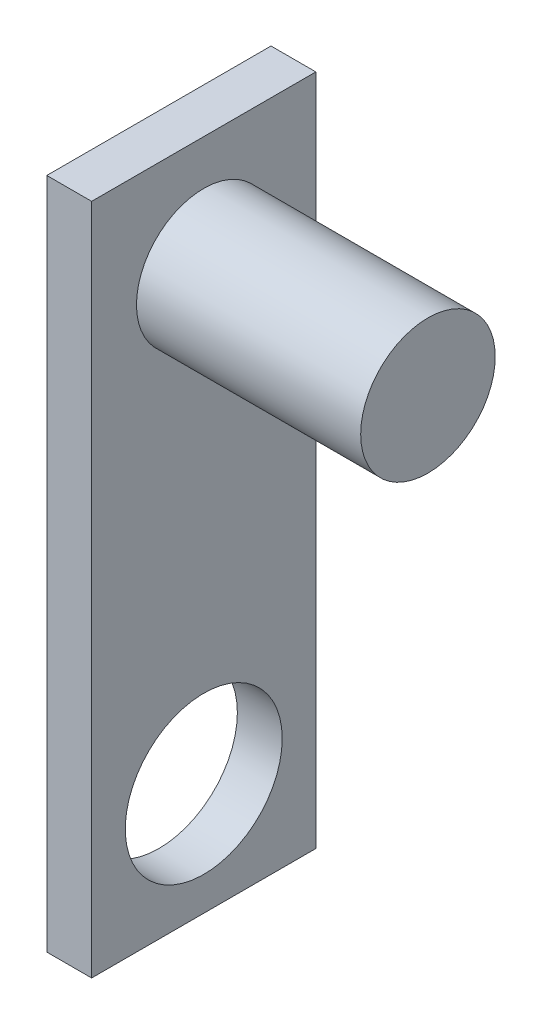
ISO-10303-21;
HEADER;
FILE_DESCRIPTION(('STEP AP214'),'2;1');
FILE_NAME('part.step','',(''),(''),'','','');
FILE_SCHEMA(('AUTOMOTIVE_DESIGN { 1 0 10303 214 1 1 1 1 }'));
ENDSEC;
DATA;
#1=APPLICATION_CONTEXT('core data for automotive mechanical design processes');
#2=APPLICATION_PROTOCOL_DEFINITION('international standard','automotive_design',2000,#1);
#3=PRODUCT_CONTEXT('',#1,'mechanical');
#4=PRODUCT('Part','Part','',(#3));
#5=PRODUCT_RELATED_PRODUCT_CATEGORY('part','',(#4));
#6=PRODUCT_DEFINITION_FORMATION('','',#4);
#7=PRODUCT_DEFINITION_CONTEXT('part definition',#1,'design');
#8=PRODUCT_DEFINITION('design','',#6,#7);
#9=PRODUCT_DEFINITION_SHAPE('','',#8);
#10=(LENGTH_UNIT() NAMED_UNIT(*) SI_UNIT(.MILLI.,.METRE.));
#11=(NAMED_UNIT(*) PLANE_ANGLE_UNIT() SI_UNIT($,.RADIAN.));
#12=(NAMED_UNIT(*) SI_UNIT($,.STERADIAN.) SOLID_ANGLE_UNIT());
#13=UNCERTAINTY_MEASURE_WITH_UNIT(LENGTH_MEASURE(1.E-05),#10,'distance_accuracy_value','');
#14=(GEOMETRIC_REPRESENTATION_CONTEXT(3) GLOBAL_UNCERTAINTY_ASSIGNED_CONTEXT((#13)) GLOBAL_UNIT_ASSIGNED_CONTEXT((#10,
#11,#12)) REPRESENTATION_CONTEXT('',''));
#15=CARTESIAN_POINT('',(0.,0.,0.));
#16=DIRECTION('',(0.,0.,1.));
#17=DIRECTION('',(1.,0.,0.));
#18=AXIS2_PLACEMENT_3D('',#15,#16,#17);
#19=CARTESIAN_POINT('',(2.,0.,0.));
#20=DIRECTION('',(-1.,0.,0.));
#21=DIRECTION('',(0.,0.,1.));
#22=AXIS2_PLACEMENT_3D('',#19,#20,#21);
#23=PLANE('',#22);
#24=DIRECTION('',(0.,1.,0.));
#25=VECTOR('',#24,1.);
#26=CARTESIAN_POINT('',(2.,-15.,-5.));
#27=LINE('',#26,#25);
#28=CARTESIAN_POINT('',(2.,-15.,-5.));
#29=VERTEX_POINT('',#28);
#30=CARTESIAN_POINT('',(2.,15.,-5.));
#31=VERTEX_POINT('',#30);
#32=EDGE_CURVE('E86',#29,#31,#27,.T.);
#33=ORIENTED_EDGE('',*,*,#32,.T.);
#34=DIRECTION('',(0.,0.,1.));
#35=VECTOR('',#34,1.);
#36=CARTESIAN_POINT('',(2.,15.,5.));
#37=LINE('',#36,#35);
#38=CARTESIAN_POINT('',(2.,15.,5.));
#39=VERTEX_POINT('',#38);
#40=EDGE_CURVE('E81',#31,#39,#37,.T.);
#41=ORIENTED_EDGE('',*,*,#40,.T.);
#42=DIRECTION('',(0.,-1.,0.));
#43=VECTOR('',#42,1.);
#44=CARTESIAN_POINT('',(2.,-15.,5.));
#45=LINE('',#44,#43);
#46=CARTESIAN_POINT('',(2.,-15.,5.));
#47=VERTEX_POINT('',#46);
#48=EDGE_CURVE('E84',#39,#47,#45,.T.);
#49=ORIENTED_EDGE('',*,*,#48,.T.);
#50=DIRECTION('',(0.,0.,-1.));
#51=VECTOR('',#50,1.);
#52=CARTESIAN_POINT('',(2.,-15.,5.));
#53=LINE('',#52,#51);
#54=EDGE_CURVE('E50',#47,#29,#53,.T.);
#55=ORIENTED_EDGE('',*,*,#54,.T.);
#56=EDGE_LOOP('',(#33,#41,#49,#55));
#57=FACE_BOUND('',#56,.T.);
#58=CARTESIAN_POINT('',(2.,-10.,0.));
#59=DIRECTION('',(1.,0.,0.));
#60=DIRECTION('',(0.,0.,-1.));
#61=AXIS2_PLACEMENT_3D('',#58,#59,#60);
#62=CIRCLE('',#61,3.5);
#63=CARTESIAN_POINT('',(2.,-10.,-3.5));
#64=VERTEX_POINT('',#63);
#65=EDGE_CURVE('E143',#64,#64,#62,.T.);
#66=ORIENTED_EDGE('',*,*,#65,.F.);
#67=EDGE_LOOP('',(#66));
#68=FACE_BOUND('',#67,.T.);
#69=CARTESIAN_POINT('',(2.,10.,0.));
#70=DIRECTION('',(-1.,0.,0.));
#71=DIRECTION('',(0.,0.,1.));
#72=AXIS2_PLACEMENT_3D('',#69,#70,#71);
#73=CIRCLE('',#72,3.);
#74=CARTESIAN_POINT('',(2.,10.,3.));
#75=VERTEX_POINT('',#74);
#76=EDGE_CURVE('E11',#75,#75,#73,.F.);
#77=ORIENTED_EDGE('',*,*,#76,.F.);
#78=EDGE_LOOP('',(#77));
#79=FACE_BOUND('',#78,.T.);
#80=ADVANCED_FACE('F33',(#57,#68,#79),#23,.F.);
#81=CARTESIAN_POINT('',(2.,-15.,-5.));
#82=DIRECTION('',(0.,0.,1.));
#83=DIRECTION('',(1.,0.,0.));
#84=AXIS2_PLACEMENT_3D('',#81,#82,#83);
#85=PLANE('',#84);
#86=DIRECTION('',(0.,1.,0.));
#87=VECTOR('',#86,1.);
#88=CARTESIAN_POINT('',(0.,-15.,-5.));
#89=LINE('',#88,#87);
#90=CARTESIAN_POINT('',(0.,-15.,-5.));
#91=VERTEX_POINT('',#90);
#92=CARTESIAN_POINT('',(0.,15.,-5.));
#93=VERTEX_POINT('',#92);
#94=EDGE_CURVE('E100',#91,#93,#89,.T.);
#95=ORIENTED_EDGE('',*,*,#94,.T.);
#96=DIRECTION('',(-1.,0.,0.));
#97=VECTOR('',#96,1.);
#98=CARTESIAN_POINT('',(2.,15.,-5.));
#99=LINE('',#98,#97);
#100=EDGE_CURVE('E42',#31,#93,#99,.T.);
#101=ORIENTED_EDGE('',*,*,#100,.F.);
#102=ORIENTED_EDGE('',*,*,#32,.F.);
#103=DIRECTION('',(-1.,0.,0.));
#104=VECTOR('',#103,1.);
#105=CARTESIAN_POINT('',(2.,-15.,-5.));
#106=LINE('',#105,#104);
#107=EDGE_CURVE('E96',#29,#91,#106,.T.);
#108=ORIENTED_EDGE('',*,*,#107,.T.);
#109=EDGE_LOOP('',(#95,#101,#102,#108));
#110=FACE_BOUND('',#109,.T.);
#111=ADVANCED_FACE('F35',(#110),#85,.F.);
#112=CARTESIAN_POINT('',(2.,15.,5.));
#113=DIRECTION('',(0.,-1.,0.));
#114=DIRECTION('',(0.,0.,-1.));
#115=AXIS2_PLACEMENT_3D('',#112,#113,#114);
#116=PLANE('',#115);
#117=DIRECTION('',(0.,0.,1.));
#118=VECTOR('',#117,1.);
#119=CARTESIAN_POINT('',(0.,15.,5.));
#120=LINE('',#119,#118);
#121=CARTESIAN_POINT('',(0.,15.,5.));
#122=VERTEX_POINT('',#121);
#123=EDGE_CURVE('E91',#93,#122,#120,.T.);
#124=ORIENTED_EDGE('',*,*,#123,.T.);
#125=DIRECTION('',(-1.,0.,0.));
#126=VECTOR('',#125,1.);
#127=CARTESIAN_POINT('',(2.,15.,5.));
#128=LINE('',#127,#126);
#129=EDGE_CURVE('E89',#39,#122,#128,.T.);
#130=ORIENTED_EDGE('',*,*,#129,.F.);
#131=ORIENTED_EDGE('',*,*,#40,.F.);
#132=ORIENTED_EDGE('',*,*,#100,.T.);
#133=EDGE_LOOP('',(#124,#130,#131,#132));
#134=FACE_BOUND('',#133,.T.);
#135=ADVANCED_FACE('F90',(#134),#116,.F.);
#136=CARTESIAN_POINT('',(2.,-15.,5.));
#137=DIRECTION('',(0.,0.,-1.));
#138=DIRECTION('',(-1.,0.,0.));
#139=AXIS2_PLACEMENT_3D('',#136,#137,#138);
#140=PLANE('',#139);
#141=DIRECTION('',(0.,-1.,0.));
#142=VECTOR('',#141,1.);
#143=CARTESIAN_POINT('',(0.,-15.,5.));
#144=LINE('',#143,#142);
#145=CARTESIAN_POINT('',(0.,-15.,5.));
#146=VERTEX_POINT('',#145);
#147=EDGE_CURVE('E67',#122,#146,#144,.T.);
#148=ORIENTED_EDGE('',*,*,#147,.T.);
#149=DIRECTION('',(-1.,0.,0.));
#150=VECTOR('',#149,1.);
#151=CARTESIAN_POINT('',(2.,-15.,5.));
#152=LINE('',#151,#150);
#153=EDGE_CURVE('E92',#47,#146,#152,.T.);
#154=ORIENTED_EDGE('',*,*,#153,.F.);
#155=ORIENTED_EDGE('',*,*,#48,.F.);
#156=ORIENTED_EDGE('',*,*,#129,.T.);
#157=EDGE_LOOP('',(#148,#154,#155,#156));
#158=FACE_BOUND('',#157,.T.);
#159=ADVANCED_FACE('F94',(#158),#140,.F.);
#160=CARTESIAN_POINT('',(2.,-15.,5.));
#161=DIRECTION('',(0.,1.,0.));
#162=DIRECTION('',(0.,0.,1.));
#163=AXIS2_PLACEMENT_3D('',#160,#161,#162);
#164=PLANE('',#163);
#165=DIRECTION('',(0.,0.,-1.));
#166=VECTOR('',#165,1.);
#167=CARTESIAN_POINT('',(0.,-15.,5.));
#168=LINE('',#167,#166);
#169=EDGE_CURVE('E73',#146,#91,#168,.T.);
#170=ORIENTED_EDGE('',*,*,#169,.T.);
#171=ORIENTED_EDGE('',*,*,#107,.F.);
#172=ORIENTED_EDGE('',*,*,#54,.F.);
#173=ORIENTED_EDGE('',*,*,#153,.T.);
#174=EDGE_LOOP('',(#170,#171,#172,#173));
#175=FACE_BOUND('',#174,.T.);
#176=ADVANCED_FACE('F114',(#175),#164,.F.);
#177=CARTESIAN_POINT('',(0.,0.,0.));
#178=DIRECTION('',(-1.,0.,0.));
#179=DIRECTION('',(0.,0.,1.));
#180=AXIS2_PLACEMENT_3D('',#177,#178,#179);
#181=PLANE('',#180);
#182=CARTESIAN_POINT('',(0.,-10.,0.));
#183=DIRECTION('',(-1.,0.,0.));
#184=DIRECTION('',(0.,0.,1.));
#185=AXIS2_PLACEMENT_3D('',#182,#183,#184);
#186=CIRCLE('',#185,3.5);
#187=CARTESIAN_POINT('',(0.,-10.,3.5));
#188=VERTEX_POINT('',#187);
#189=EDGE_CURVE('E103',#188,#188,#186,.F.);
#190=ORIENTED_EDGE('',*,*,#189,.T.);
#191=EDGE_LOOP('',(#190));
#192=FACE_BOUND('',#191,.T.);
#193=ORIENTED_EDGE('',*,*,#94,.F.);
#194=ORIENTED_EDGE('',*,*,#169,.F.);
#195=ORIENTED_EDGE('',*,*,#147,.F.);
#196=ORIENTED_EDGE('',*,*,#123,.F.);
#197=EDGE_LOOP('',(#193,#194,#195,#196));
#198=FACE_BOUND('',#197,.T.);
#199=ADVANCED_FACE('F111',(#192,#198),#181,.T.);
#200=CARTESIAN_POINT('',(-9.89949493661167,-10.,0.));
#201=DIRECTION('',(1.,0.,0.));
#202=DIRECTION('',(0.,0.,-1.));
#203=AXIS2_PLACEMENT_3D('',#200,#201,#202);
#204=CYLINDRICAL_SURFACE('',#203,3.5);
#205=ORIENTED_EDGE('',*,*,#65,.T.);
#206=EDGE_LOOP('',(#205));
#207=FACE_BOUND('',#206,.T.);
#208=ORIENTED_EDGE('',*,*,#189,.F.);
#209=EDGE_LOOP('',(#208));
#210=FACE_BOUND('',#209,.T.);
#211=ADVANCED_FACE('F113',(#207,#210),#204,.F.);
#212=CARTESIAN_POINT('',(12.,10.,0.));
#213=DIRECTION('',(-1.,0.,0.));
#214=DIRECTION('',(0.,0.,1.));
#215=AXIS2_PLACEMENT_3D('',#212,#213,#214);
#216=CYLINDRICAL_SURFACE('',#215,3.);
#217=CARTESIAN_POINT('',(12.,10.,0.));
#218=DIRECTION('',(1.,0.,0.));
#219=DIRECTION('',(0.,0.,-1.));
#220=AXIS2_PLACEMENT_3D('',#217,#218,#219);
#221=CIRCLE('',#220,3.);
#222=CARTESIAN_POINT('',(12.,10.,-3.));
#223=VERTEX_POINT('',#222);
#224=EDGE_CURVE('E142',#223,#223,#221,.T.);
#225=ORIENTED_EDGE('',*,*,#224,.F.);
#226=EDGE_LOOP('',(#225));
#227=FACE_BOUND('',#226,.T.);
#228=ORIENTED_EDGE('',*,*,#76,.T.);
#229=EDGE_LOOP('',(#228));
#230=FACE_BOUND('',#229,.T.);
#231=ADVANCED_FACE('F121',(#227,#230),#216,.T.);
#232=CARTESIAN_POINT('',(12.,10.,0.));
#233=DIRECTION('',(1.,0.,0.));
#234=DIRECTION('',(0.,0.,-1.));
#235=AXIS2_PLACEMENT_3D('',#232,#233,#234);
#236=PLANE('',#235);
#237=ORIENTED_EDGE('',*,*,#224,.T.);
#238=EDGE_LOOP('',(#237));
#239=FACE_BOUND('',#238,.T.);
#240=ADVANCED_FACE('F134',(#239),#236,.T.);
#241=CLOSED_SHELL('',(#80,#111,#135,#159,#176,#199,#211,#231,#240));
#242=MANIFOLD_SOLID_BREP('B2',#241);
#243=ADVANCED_BREP_SHAPE_REPRESENTATION('',(#18,#242),#14);
#244=SHAPE_DEFINITION_REPRESENTATION(#9,#243);
ENDSEC;
END-ISO-10303-21;
